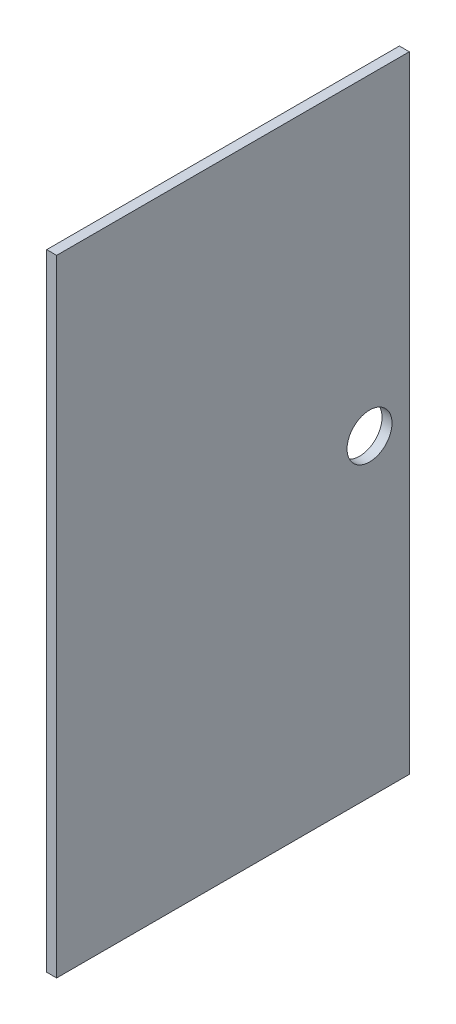
ISO-10303-21;
HEADER;
FILE_DESCRIPTION(('STEP AP214'),'2;1');
FILE_NAME('part.step','',(''),(''),'','','');
FILE_SCHEMA(('AUTOMOTIVE_DESIGN { 1 0 10303 214 1 1 1 1 }'));
ENDSEC;
DATA;
#1=APPLICATION_CONTEXT('core data for automotive mechanical design processes');
#2=APPLICATION_PROTOCOL_DEFINITION('international standard','automotive_design',2000,#1);
#3=PRODUCT_CONTEXT('',#1,'mechanical');
#4=PRODUCT('Part','Part','',(#3));
#5=PRODUCT_RELATED_PRODUCT_CATEGORY('part','',(#4));
#6=PRODUCT_DEFINITION_FORMATION('','',#4);
#7=PRODUCT_DEFINITION_CONTEXT('part definition',#1,'design');
#8=PRODUCT_DEFINITION('design','',#6,#7);
#9=PRODUCT_DEFINITION_SHAPE('','',#8);
#10=(LENGTH_UNIT() NAMED_UNIT(*) SI_UNIT(.MILLI.,.METRE.));
#11=(NAMED_UNIT(*) PLANE_ANGLE_UNIT() SI_UNIT($,.RADIAN.));
#12=(NAMED_UNIT(*) SI_UNIT($,.STERADIAN.) SOLID_ANGLE_UNIT());
#13=UNCERTAINTY_MEASURE_WITH_UNIT(LENGTH_MEASURE(1.E-05),#10,'distance_accuracy_value','');
#14=(GEOMETRIC_REPRESENTATION_CONTEXT(3) GLOBAL_UNCERTAINTY_ASSIGNED_CONTEXT((#13)) GLOBAL_UNIT_ASSIGNED_CONTEXT((#10,
#11,#12)) REPRESENTATION_CONTEXT('',''));
#15=CARTESIAN_POINT('',(0.,0.,0.));
#16=DIRECTION('',(0.,0.,1.));
#17=DIRECTION('',(1.,0.,0.));
#18=AXIS2_PLACEMENT_3D('',#15,#16,#17);
#19=CARTESIAN_POINT('',(6.35,0.,0.));
#20=DIRECTION('',(0.,0.,-1.));
#21=DIRECTION('',(-1.,0.,0.));
#22=AXIS2_PLACEMENT_3D('',#19,#20,#21);
#23=PLANE('',#22);
#24=DIRECTION('',(0.,-1.,0.));
#25=VECTOR('',#24,1.);
#26=CARTESIAN_POINT('',(0.,0.,0.));
#27=LINE('',#26,#25);
#28=CARTESIAN_POINT('',(0.,399.796,0.));
#29=VERTEX_POINT('',#28);
#30=CARTESIAN_POINT('',(0.,0.,0.));
#31=VERTEX_POINT('',#30);
#32=EDGE_CURVE('E96',#29,#31,#27,.T.);
#33=ORIENTED_EDGE('',*,*,#32,.T.);
#34=DIRECTION('',(-1.,0.,0.));
#35=VECTOR('',#34,1.);
#36=CARTESIAN_POINT('',(6.35,0.,0.));
#37=LINE('',#36,#35);
#38=CARTESIAN_POINT('',(6.35,0.,0.));
#39=VERTEX_POINT('',#38);
#40=EDGE_CURVE('E11',#39,#31,#37,.T.);
#41=ORIENTED_EDGE('',*,*,#40,.F.);
#42=DIRECTION('',(0.,-1.,0.));
#43=VECTOR('',#42,1.);
#44=CARTESIAN_POINT('',(6.35,0.,0.));
#45=LINE('',#44,#43);
#46=CARTESIAN_POINT('',(6.35,399.796,0.));
#47=VERTEX_POINT('',#46);
#48=EDGE_CURVE('E84',#47,#39,#45,.T.);
#49=ORIENTED_EDGE('',*,*,#48,.F.);
#50=DIRECTION('',(-1.,0.,0.));
#51=VECTOR('',#50,1.);
#52=CARTESIAN_POINT('',(6.35,399.796,0.));
#53=LINE('',#52,#51);
#54=EDGE_CURVE('E92',#47,#29,#53,.T.);
#55=ORIENTED_EDGE('',*,*,#54,.T.);
#56=EDGE_LOOP('',(#33,#41,#49,#55));
#57=FACE_BOUND('',#56,.T.);
#58=ADVANCED_FACE('F33',(#57),#23,.F.);
#59=CARTESIAN_POINT('',(6.35,0.,0.));
#60=DIRECTION('',(0.,1.,0.));
#61=DIRECTION('',(0.,0.,1.));
#62=AXIS2_PLACEMENT_3D('',#59,#60,#61);
#63=PLANE('',#62);
#64=DIRECTION('',(0.,0.,-1.));
#65=VECTOR('',#64,1.);
#66=CARTESIAN_POINT('',(0.,0.,0.));
#67=LINE('',#66,#65);
#68=CARTESIAN_POINT('',(0.,0.,-225.298));
#69=VERTEX_POINT('',#68);
#70=EDGE_CURVE('E88',#31,#69,#67,.T.);
#71=ORIENTED_EDGE('',*,*,#70,.T.);
#72=DIRECTION('',(-1.,0.,0.));
#73=VECTOR('',#72,1.);
#74=CARTESIAN_POINT('',(6.35,0.,-225.298));
#75=LINE('',#74,#73);
#76=CARTESIAN_POINT('',(6.35,0.,-225.298));
#77=VERTEX_POINT('',#76);
#78=EDGE_CURVE('E41',#77,#69,#75,.T.);
#79=ORIENTED_EDGE('',*,*,#78,.F.);
#80=DIRECTION('',(0.,0.,-1.));
#81=VECTOR('',#80,1.);
#82=CARTESIAN_POINT('',(6.35,0.,0.));
#83=LINE('',#82,#81);
#84=EDGE_CURVE('E79',#39,#77,#83,.T.);
#85=ORIENTED_EDGE('',*,*,#84,.F.);
#86=ORIENTED_EDGE('',*,*,#40,.T.);
#87=EDGE_LOOP('',(#71,#79,#85,#86));
#88=FACE_BOUND('',#87,.T.);
#89=ADVANCED_FACE('F87',(#88),#63,.F.);
#90=CARTESIAN_POINT('',(6.35,0.,-225.298));
#91=DIRECTION('',(0.,0.,1.));
#92=DIRECTION('',(1.,0.,0.));
#93=AXIS2_PLACEMENT_3D('',#90,#91,#92);
#94=PLANE('',#93);
#95=DIRECTION('',(0.,1.,0.));
#96=VECTOR('',#95,1.);
#97=CARTESIAN_POINT('',(0.,0.,-225.298));
#98=LINE('',#97,#96);
#99=CARTESIAN_POINT('',(0.,399.796,-225.298));
#100=VERTEX_POINT('',#99);
#101=EDGE_CURVE('E66',#69,#100,#98,.T.);
#102=ORIENTED_EDGE('',*,*,#101,.T.);
#103=DIRECTION('',(-1.,0.,0.));
#104=VECTOR('',#103,1.);
#105=CARTESIAN_POINT('',(6.35,399.796,-225.298));
#106=LINE('',#105,#104);
#107=CARTESIAN_POINT('',(6.35,399.796,-225.298));
#108=VERTEX_POINT('',#107);
#109=EDGE_CURVE('E89',#108,#100,#106,.T.);
#110=ORIENTED_EDGE('',*,*,#109,.F.);
#111=DIRECTION('',(0.,1.,0.));
#112=VECTOR('',#111,1.);
#113=CARTESIAN_POINT('',(6.35,0.,-225.298));
#114=LINE('',#113,#112);
#115=EDGE_CURVE('E82',#77,#108,#114,.T.);
#116=ORIENTED_EDGE('',*,*,#115,.F.);
#117=ORIENTED_EDGE('',*,*,#78,.T.);
#118=EDGE_LOOP('',(#102,#110,#116,#117));
#119=FACE_BOUND('',#118,.T.);
#120=ADVANCED_FACE('F90',(#119),#94,.F.);
#121=CARTESIAN_POINT('',(6.35,399.796,0.));
#122=DIRECTION('',(0.,-1.,0.));
#123=DIRECTION('',(0.,0.,-1.));
#124=AXIS2_PLACEMENT_3D('',#121,#122,#123);
#125=PLANE('',#124);
#126=DIRECTION('',(0.,0.,1.));
#127=VECTOR('',#126,1.);
#128=CARTESIAN_POINT('',(0.,399.796,0.));
#129=LINE('',#128,#127);
#130=EDGE_CURVE('E72',#100,#29,#129,.T.);
#131=ORIENTED_EDGE('',*,*,#130,.T.);
#132=ORIENTED_EDGE('',*,*,#54,.F.);
#133=DIRECTION('',(0.,0.,1.));
#134=VECTOR('',#133,1.);
#135=CARTESIAN_POINT('',(6.35,399.796,0.));
#136=LINE('',#135,#134);
#137=EDGE_CURVE('E49',#108,#47,#136,.T.);
#138=ORIENTED_EDGE('',*,*,#137,.F.);
#139=ORIENTED_EDGE('',*,*,#109,.T.);
#140=EDGE_LOOP('',(#131,#132,#138,#139));
#141=FACE_BOUND('',#140,.T.);
#142=ADVANCED_FACE('F104',(#141),#125,.F.);
#143=CARTESIAN_POINT('',(6.35,0.,0.));
#144=DIRECTION('',(-1.,0.,0.));
#145=DIRECTION('',(0.,0.,1.));
#146=AXIS2_PLACEMENT_3D('',#143,#144,#145);
#147=PLANE('',#146);
#148=CARTESIAN_POINT('',(6.35,199.898,-199.898));
#149=DIRECTION('',(-1.,0.,0.));
#150=DIRECTION('',(0.,0.,1.));
#151=AXIS2_PLACEMENT_3D('',#148,#149,#150);
#152=CIRCLE('',#151,14.351);
#153=CARTESIAN_POINT('',(6.35,199.898,-185.547));
#154=VERTEX_POINT('',#153);
#155=EDGE_CURVE('E99',#154,#154,#152,.T.);
#156=ORIENTED_EDGE('',*,*,#155,.T.);
#157=EDGE_LOOP('',(#156));
#158=FACE_BOUND('',#157,.T.);
#159=ORIENTED_EDGE('',*,*,#48,.T.);
#160=ORIENTED_EDGE('',*,*,#84,.T.);
#161=ORIENTED_EDGE('',*,*,#115,.T.);
#162=ORIENTED_EDGE('',*,*,#137,.T.);
#163=EDGE_LOOP('',(#159,#160,#161,#162));
#164=FACE_BOUND('',#163,.T.);
#165=ADVANCED_FACE('F80',(#158,#164),#147,.F.);
#166=CARTESIAN_POINT('',(0.,0.,0.));
#167=DIRECTION('',(-1.,0.,0.));
#168=DIRECTION('',(0.,0.,1.));
#169=AXIS2_PLACEMENT_3D('',#166,#167,#168);
#170=PLANE('',#169);
#171=CARTESIAN_POINT('',(0.,199.898,-199.898));
#172=DIRECTION('',(1.,0.,0.));
#173=DIRECTION('',(0.,0.,-1.));
#174=AXIS2_PLACEMENT_3D('',#171,#172,#173);
#175=CIRCLE('',#174,14.351);
#176=CARTESIAN_POINT('',(0.,199.898,-214.249));
#177=VERTEX_POINT('',#176);
#178=EDGE_CURVE('E112',#177,#177,#175,.T.);
#179=ORIENTED_EDGE('',*,*,#178,.T.);
#180=EDGE_LOOP('',(#179));
#181=FACE_BOUND('',#180,.T.);
#182=ORIENTED_EDGE('',*,*,#32,.F.);
#183=ORIENTED_EDGE('',*,*,#130,.F.);
#184=ORIENTED_EDGE('',*,*,#101,.F.);
#185=ORIENTED_EDGE('',*,*,#70,.F.);
#186=EDGE_LOOP('',(#182,#183,#184,#185));
#187=FACE_BOUND('',#186,.T.);
#188=ADVANCED_FACE('F107',(#181,#187),#170,.T.);
#189=CARTESIAN_POINT('',(0.,199.898,-199.898));
#190=DIRECTION('',(1.,0.,0.));
#191=DIRECTION('',(0.,0.,-1.));
#192=AXIS2_PLACEMENT_3D('',#189,#190,#191);
#193=CYLINDRICAL_SURFACE('',#192,14.351);
#194=ORIENTED_EDGE('',*,*,#178,.F.);
#195=EDGE_LOOP('',(#194));
#196=FACE_BOUND('',#195,.T.);
#197=ORIENTED_EDGE('',*,*,#155,.F.);
#198=EDGE_LOOP('',(#197));
#199=FACE_BOUND('',#198,.T.);
#200=ADVANCED_FACE('F117',(#196,#199),#193,.F.);
#201=CLOSED_SHELL('',(#58,#89,#120,#142,#165,#188,#200));
#202=MANIFOLD_SOLID_BREP('B2',#201);
#203=ADVANCED_BREP_SHAPE_REPRESENTATION('',(#18,#202),#14);
#204=SHAPE_DEFINITION_REPRESENTATION(#9,#203);
ENDSEC;
END-ISO-10303-21;
